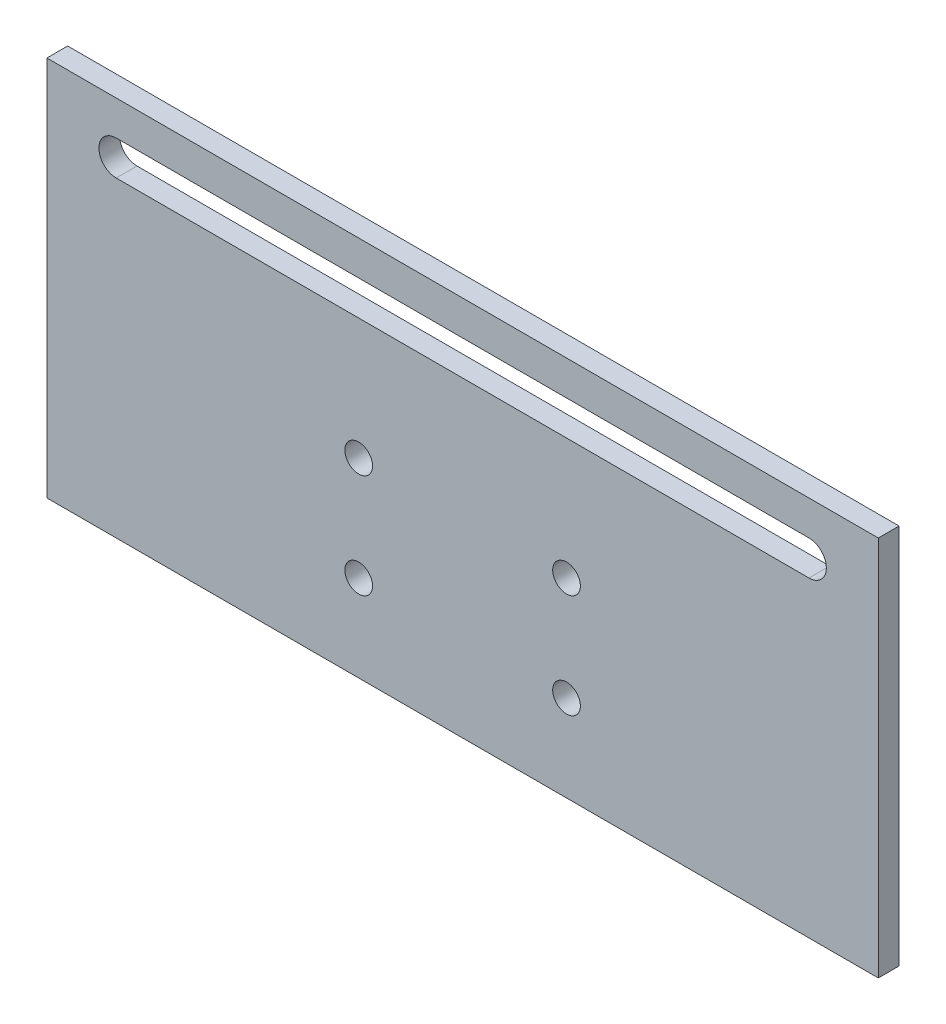
ISO-10303-21;
HEADER;
FILE_DESCRIPTION(('STEP AP214'),'2;1');
FILE_NAME('part.step','',(''),(''),'','','');
FILE_SCHEMA(('AUTOMOTIVE_DESIGN { 1 0 10303 214 1 1 1 1 }'));
ENDSEC;
DATA;
#1=APPLICATION_CONTEXT('core data for automotive mechanical design processes');
#2=APPLICATION_PROTOCOL_DEFINITION('international standard','automotive_design',2000,#1);
#3=PRODUCT_CONTEXT('',#1,'mechanical');
#4=PRODUCT('Part','Part','',(#3));
#5=PRODUCT_RELATED_PRODUCT_CATEGORY('part','',(#4));
#6=PRODUCT_DEFINITION_FORMATION('','',#4);
#7=PRODUCT_DEFINITION_CONTEXT('part definition',#1,'design');
#8=PRODUCT_DEFINITION('design','',#6,#7);
#9=PRODUCT_DEFINITION_SHAPE('','',#8);
#10=(LENGTH_UNIT() NAMED_UNIT(*) SI_UNIT(.MILLI.,.METRE.));
#11=(NAMED_UNIT(*) PLANE_ANGLE_UNIT() SI_UNIT($,.RADIAN.));
#12=(NAMED_UNIT(*) SI_UNIT($,.STERADIAN.) SOLID_ANGLE_UNIT());
#13=UNCERTAINTY_MEASURE_WITH_UNIT(LENGTH_MEASURE(1.E-05),#10,'distance_accuracy_value','');
#14=(GEOMETRIC_REPRESENTATION_CONTEXT(3) GLOBAL_UNCERTAINTY_ASSIGNED_CONTEXT((#13)) GLOBAL_UNIT_ASSIGNED_CONTEXT((#10,
#11,#12)) REPRESENTATION_CONTEXT('',''));
#15=CARTESIAN_POINT('',(0.,0.,0.));
#16=DIRECTION('',(0.,0.,1.));
#17=DIRECTION('',(1.,0.,0.));
#18=AXIS2_PLACEMENT_3D('',#15,#16,#17);
#19=CARTESIAN_POINT('',(0.,0.,1.5));
#20=DIRECTION('',(0.,0.,1.));
#21=DIRECTION('',(1.,0.,0.));
#22=AXIS2_PLACEMENT_3D('',#19,#20,#21);
#23=PLANE('',#22);
#24=CARTESIAN_POINT('',(15.,-15.,1.5));
#25=DIRECTION('',(0.,0.,1.));
#26=DIRECTION('',(1.,0.,0.));
#27=AXIS2_PLACEMENT_3D('',#24,#25,#26);
#28=CIRCLE('',#27,2.);
#29=CARTESIAN_POINT('',(17.,-15.,1.5));
#30=VERTEX_POINT('',#29);
#31=EDGE_CURVE('E245',#30,#30,#28,.T.);
#32=ORIENTED_EDGE('',*,*,#31,.F.);
#33=EDGE_LOOP('',(#32));
#34=FACE_BOUND('',#33,.T.);
#35=CARTESIAN_POINT('',(-15.,0.,1.5));
#36=DIRECTION('',(0.,0.,1.));
#37=DIRECTION('',(1.,0.,0.));
#38=AXIS2_PLACEMENT_3D('',#35,#36,#37);
#39=CIRCLE('',#38,2.);
#40=CARTESIAN_POINT('',(-13.,0.,1.5));
#41=VERTEX_POINT('',#40);
#42=EDGE_CURVE('E127',#41,#41,#39,.T.);
#43=ORIENTED_EDGE('',*,*,#42,.F.);
#44=EDGE_LOOP('',(#43));
#45=FACE_BOUND('',#44,.T.);
#46=DIRECTION('',(0.,1.,0.));
#47=VECTOR('',#46,1.);
#48=CARTESIAN_POINT('',(60.,27.5,1.5));
#49=LINE('',#48,#47);
#50=CARTESIAN_POINT('',(60.,-27.5,1.5));
#51=VERTEX_POINT('',#50);
#52=CARTESIAN_POINT('',(60.,27.5,1.5));
#53=VERTEX_POINT('',#52);
#54=EDGE_CURVE('E137',#51,#53,#49,.T.);
#55=ORIENTED_EDGE('',*,*,#54,.T.);
#56=DIRECTION('',(-1.,0.,0.));
#57=VECTOR('',#56,1.);
#58=CARTESIAN_POINT('',(-60.,27.5,1.5));
#59=LINE('',#58,#57);
#60=CARTESIAN_POINT('',(-60.,27.5,1.5));
#61=VERTEX_POINT('',#60);
#62=EDGE_CURVE('E140',#53,#61,#59,.T.);
#63=ORIENTED_EDGE('',*,*,#62,.T.);
#64=DIRECTION('',(0.,-1.,0.));
#65=VECTOR('',#64,1.);
#66=CARTESIAN_POINT('',(-60.,27.5,1.5));
#67=LINE('',#66,#65);
#68=CARTESIAN_POINT('',(-60.,-27.5,1.5));
#69=VERTEX_POINT('',#68);
#70=EDGE_CURVE('E143',#61,#69,#67,.T.);
#71=ORIENTED_EDGE('',*,*,#70,.T.);
#72=DIRECTION('',(1.,0.,0.));
#73=VECTOR('',#72,1.);
#74=CARTESIAN_POINT('',(-60.,-27.5,1.5));
#75=LINE('',#74,#73);
#76=EDGE_CURVE('E145',#69,#51,#75,.T.);
#77=ORIENTED_EDGE('',*,*,#76,.T.);
#78=EDGE_LOOP('',(#55,#63,#71,#77));
#79=FACE_BOUND('',#78,.T.);
#80=DIRECTION('',(1.,0.,0.));
#81=VECTOR('',#80,1.);
#82=CARTESIAN_POINT('',(-50.,17.5,1.5));
#83=LINE('',#82,#81);
#84=CARTESIAN_POINT('',(-50.,17.5,1.5));
#85=VERTEX_POINT('',#84);
#86=CARTESIAN_POINT('',(50.,17.5,1.5));
#87=VERTEX_POINT('',#86);
#88=EDGE_CURVE('E106',#85,#87,#83,.T.);
#89=ORIENTED_EDGE('',*,*,#88,.F.);
#90=CARTESIAN_POINT('',(-50.,20.,1.5));
#91=DIRECTION('',(0.,0.,1.));
#92=DIRECTION('',(1.,0.,0.));
#93=AXIS2_PLACEMENT_3D('',#90,#91,#92);
#94=CIRCLE('',#93,2.5);
#95=CARTESIAN_POINT('',(-50.,22.5,1.5));
#96=VERTEX_POINT('',#95);
#97=EDGE_CURVE('E98',#96,#85,#94,.T.);
#98=ORIENTED_EDGE('',*,*,#97,.F.);
#99=DIRECTION('',(-1.,0.,0.));
#100=VECTOR('',#99,1.);
#101=CARTESIAN_POINT('',(-50.,22.5,1.5));
#102=LINE('',#101,#100);
#103=CARTESIAN_POINT('',(50.,22.5,1.5));
#104=VERTEX_POINT('',#103);
#105=EDGE_CURVE('E121',#104,#96,#102,.T.);
#106=ORIENTED_EDGE('',*,*,#105,.F.);
#107=CARTESIAN_POINT('',(50.,20.,1.5));
#108=DIRECTION('',(0.,0.,1.));
#109=DIRECTION('',(1.,0.,0.));
#110=AXIS2_PLACEMENT_3D('',#107,#108,#109);
#111=CIRCLE('',#110,2.5);
#112=EDGE_CURVE('E119',#87,#104,#111,.T.);
#113=ORIENTED_EDGE('',*,*,#112,.F.);
#114=EDGE_LOOP('',(#89,#98,#106,#113));
#115=FACE_BOUND('',#114,.T.);
#116=CARTESIAN_POINT('',(15.,0.,1.5));
#117=DIRECTION('',(0.,0.,1.));
#118=DIRECTION('',(1.,0.,0.));
#119=AXIS2_PLACEMENT_3D('',#116,#117,#118);
#120=CIRCLE('',#119,2.);
#121=CARTESIAN_POINT('',(17.,0.,1.5));
#122=VERTEX_POINT('',#121);
#123=EDGE_CURVE('E251',#122,#122,#120,.T.);
#124=ORIENTED_EDGE('',*,*,#123,.F.);
#125=EDGE_LOOP('',(#124));
#126=FACE_BOUND('',#125,.T.);
#127=CARTESIAN_POINT('',(-15.,-15.,1.5));
#128=DIRECTION('',(0.,0.,1.));
#129=DIRECTION('',(1.,0.,0.));
#130=AXIS2_PLACEMENT_3D('',#127,#128,#129);
#131=CIRCLE('',#130,2.);
#132=CARTESIAN_POINT('',(-13.,-15.,1.5));
#133=VERTEX_POINT('',#132);
#134=EDGE_CURVE('E236',#133,#133,#131,.T.);
#135=ORIENTED_EDGE('',*,*,#134,.F.);
#136=EDGE_LOOP('',(#135));
#137=FACE_BOUND('',#136,.T.);
#138=ADVANCED_FACE('F33',(#34,#45,#79,#115,#126,#137),#23,.T.);
#139=CARTESIAN_POINT('',(0.,0.,-1.5));
#140=DIRECTION('',(0.,0.,1.));
#141=DIRECTION('',(1.,0.,0.));
#142=AXIS2_PLACEMENT_3D('',#139,#140,#141);
#143=PLANE('',#142);
#144=DIRECTION('',(0.,1.,0.));
#145=VECTOR('',#144,1.);
#146=CARTESIAN_POINT('',(60.,27.5,-1.5));
#147=LINE('',#146,#145);
#148=CARTESIAN_POINT('',(60.,-27.5,-1.5));
#149=VERTEX_POINT('',#148);
#150=CARTESIAN_POINT('',(60.,27.5,-1.5));
#151=VERTEX_POINT('',#150);
#152=EDGE_CURVE('E114',#149,#151,#147,.T.);
#153=ORIENTED_EDGE('',*,*,#152,.F.);
#154=DIRECTION('',(1.,0.,0.));
#155=VECTOR('',#154,1.);
#156=CARTESIAN_POINT('',(-60.,-27.5,-1.5));
#157=LINE('',#156,#155);
#158=CARTESIAN_POINT('',(-60.,-27.5,-1.5));
#159=VERTEX_POINT('',#158);
#160=EDGE_CURVE('E141',#159,#149,#157,.T.);
#161=ORIENTED_EDGE('',*,*,#160,.F.);
#162=DIRECTION('',(0.,-1.,0.));
#163=VECTOR('',#162,1.);
#164=CARTESIAN_POINT('',(-60.,27.5,-1.5));
#165=LINE('',#164,#163);
#166=CARTESIAN_POINT('',(-60.,27.5,-1.5));
#167=VERTEX_POINT('',#166);
#168=EDGE_CURVE('E152',#167,#159,#165,.T.);
#169=ORIENTED_EDGE('',*,*,#168,.F.);
#170=DIRECTION('',(-1.,0.,0.));
#171=VECTOR('',#170,1.);
#172=CARTESIAN_POINT('',(-60.,27.5,-1.5));
#173=LINE('',#172,#171);
#174=EDGE_CURVE('E150',#151,#167,#173,.T.);
#175=ORIENTED_EDGE('',*,*,#174,.F.);
#176=EDGE_LOOP('',(#153,#161,#169,#175));
#177=FACE_BOUND('',#176,.T.);
#178=CARTESIAN_POINT('',(-50.,20.,-1.5));
#179=DIRECTION('',(0.,0.,1.));
#180=DIRECTION('',(1.,0.,0.));
#181=AXIS2_PLACEMENT_3D('',#178,#179,#180);
#182=CIRCLE('',#181,2.5);
#183=CARTESIAN_POINT('',(-50.,22.5,-1.5));
#184=VERTEX_POINT('',#183);
#185=CARTESIAN_POINT('',(-50.,17.5,-1.5));
#186=VERTEX_POINT('',#185);
#187=EDGE_CURVE('E56',#184,#186,#182,.T.);
#188=ORIENTED_EDGE('',*,*,#187,.T.);
#189=DIRECTION('',(1.,0.,0.));
#190=VECTOR('',#189,1.);
#191=CARTESIAN_POINT('',(-50.,17.5,-1.5));
#192=LINE('',#191,#190);
#193=CARTESIAN_POINT('',(50.,17.5,-1.5));
#194=VERTEX_POINT('',#193);
#195=EDGE_CURVE('E113',#186,#194,#192,.T.);
#196=ORIENTED_EDGE('',*,*,#195,.T.);
#197=CARTESIAN_POINT('',(50.,20.,-1.5));
#198=DIRECTION('',(0.,0.,1.));
#199=DIRECTION('',(1.,0.,0.));
#200=AXIS2_PLACEMENT_3D('',#197,#198,#199);
#201=CIRCLE('',#200,2.5);
#202=CARTESIAN_POINT('',(50.,22.5,-1.5));
#203=VERTEX_POINT('',#202);
#204=EDGE_CURVE('E129',#194,#203,#201,.T.);
#205=ORIENTED_EDGE('',*,*,#204,.T.);
#206=DIRECTION('',(-1.,0.,0.));
#207=VECTOR('',#206,1.);
#208=CARTESIAN_POINT('',(-50.,22.5,-1.5));
#209=LINE('',#208,#207);
#210=EDGE_CURVE('E107',#203,#184,#209,.T.);
#211=ORIENTED_EDGE('',*,*,#210,.T.);
#212=EDGE_LOOP('',(#188,#196,#205,#211));
#213=FACE_BOUND('',#212,.T.);
#214=CARTESIAN_POINT('',(-15.,0.,-1.5));
#215=DIRECTION('',(0.,0.,1.));
#216=DIRECTION('',(1.,0.,0.));
#217=AXIS2_PLACEMENT_3D('',#214,#215,#216);
#218=CIRCLE('',#217,2.);
#219=CARTESIAN_POINT('',(-13.,0.,-1.5));
#220=VERTEX_POINT('',#219);
#221=EDGE_CURVE('E254',#220,#220,#218,.T.);
#222=ORIENTED_EDGE('',*,*,#221,.T.);
#223=EDGE_LOOP('',(#222));
#224=FACE_BOUND('',#223,.T.);
#225=CARTESIAN_POINT('',(15.,0.,-1.5));
#226=DIRECTION('',(0.,0.,1.));
#227=DIRECTION('',(1.,0.,0.));
#228=AXIS2_PLACEMENT_3D('',#225,#226,#227);
#229=CIRCLE('',#228,2.);
#230=CARTESIAN_POINT('',(17.,0.,-1.5));
#231=VERTEX_POINT('',#230);
#232=EDGE_CURVE('E248',#231,#231,#229,.T.);
#233=ORIENTED_EDGE('',*,*,#232,.T.);
#234=EDGE_LOOP('',(#233));
#235=FACE_BOUND('',#234,.T.);
#236=CARTESIAN_POINT('',(15.,-15.,-1.5));
#237=DIRECTION('',(0.,0.,1.));
#238=DIRECTION('',(1.,0.,0.));
#239=AXIS2_PLACEMENT_3D('',#236,#237,#238);
#240=CIRCLE('',#239,2.);
#241=CARTESIAN_POINT('',(17.,-15.,-1.5));
#242=VERTEX_POINT('',#241);
#243=EDGE_CURVE('E242',#242,#242,#240,.T.);
#244=ORIENTED_EDGE('',*,*,#243,.T.);
#245=EDGE_LOOP('',(#244));
#246=FACE_BOUND('',#245,.T.);
#247=CARTESIAN_POINT('',(-15.,-15.,-1.5));
#248=DIRECTION('',(0.,0.,1.));
#249=DIRECTION('',(1.,0.,0.));
#250=AXIS2_PLACEMENT_3D('',#247,#248,#249);
#251=CIRCLE('',#250,2.);
#252=CARTESIAN_POINT('',(-13.,-15.,-1.5));
#253=VERTEX_POINT('',#252);
#254=EDGE_CURVE('E239',#253,#253,#251,.T.);
#255=ORIENTED_EDGE('',*,*,#254,.T.);
#256=EDGE_LOOP('',(#255));
#257=FACE_BOUND('',#256,.T.);
#258=ADVANCED_FACE('F170',(#177,#213,#224,#235,#246,#257),#143,.F.);
#259=CARTESIAN_POINT('',(60.,27.5,1.5));
#260=DIRECTION('',(-1.,0.,0.));
#261=DIRECTION('',(0.,-1.,0.));
#262=AXIS2_PLACEMENT_3D('',#259,#260,#261);
#263=PLANE('',#262);
#264=ORIENTED_EDGE('',*,*,#152,.T.);
#265=DIRECTION('',(0.,0.,-1.));
#266=VECTOR('',#265,1.);
#267=CARTESIAN_POINT('',(60.,27.5,1.5));
#268=LINE('',#267,#266);
#269=EDGE_CURVE('E11',#53,#151,#268,.T.);
#270=ORIENTED_EDGE('',*,*,#269,.F.);
#271=ORIENTED_EDGE('',*,*,#54,.F.);
#272=DIRECTION('',(0.,0.,-1.));
#273=VECTOR('',#272,1.);
#274=CARTESIAN_POINT('',(60.,-27.5,1.5));
#275=LINE('',#274,#273);
#276=EDGE_CURVE('E147',#51,#149,#275,.T.);
#277=ORIENTED_EDGE('',*,*,#276,.T.);
#278=EDGE_LOOP('',(#264,#270,#271,#277));
#279=FACE_BOUND('',#278,.T.);
#280=ADVANCED_FACE('F35',(#279),#263,.F.);
#281=CARTESIAN_POINT('',(-60.,27.5,1.5));
#282=DIRECTION('',(0.,-1.,0.));
#283=DIRECTION('',(0.,0.,-1.));
#284=AXIS2_PLACEMENT_3D('',#281,#282,#283);
#285=PLANE('',#284);
#286=ORIENTED_EDGE('',*,*,#174,.T.);
#287=DIRECTION('',(0.,0.,-1.));
#288=VECTOR('',#287,1.);
#289=CARTESIAN_POINT('',(-60.,27.5,1.5));
#290=LINE('',#289,#288);
#291=EDGE_CURVE('E41',#61,#167,#290,.T.);
#292=ORIENTED_EDGE('',*,*,#291,.F.);
#293=ORIENTED_EDGE('',*,*,#62,.F.);
#294=ORIENTED_EDGE('',*,*,#269,.T.);
#295=EDGE_LOOP('',(#286,#292,#293,#294));
#296=FACE_BOUND('',#295,.T.);
#297=ADVANCED_FACE('F180',(#296),#285,.F.);
#298=CARTESIAN_POINT('',(-60.,27.5,1.5));
#299=DIRECTION('',(1.,0.,0.));
#300=DIRECTION('',(0.,0.,-1.));
#301=AXIS2_PLACEMENT_3D('',#298,#299,#300);
#302=PLANE('',#301);
#303=ORIENTED_EDGE('',*,*,#168,.T.);
#304=DIRECTION('',(0.,0.,-1.));
#305=VECTOR('',#304,1.);
#306=CARTESIAN_POINT('',(-60.,-27.5,1.5));
#307=LINE('',#306,#305);
#308=EDGE_CURVE('E157',#69,#159,#307,.T.);
#309=ORIENTED_EDGE('',*,*,#308,.F.);
#310=ORIENTED_EDGE('',*,*,#70,.F.);
#311=ORIENTED_EDGE('',*,*,#291,.T.);
#312=EDGE_LOOP('',(#303,#309,#310,#311));
#313=FACE_BOUND('',#312,.T.);
#314=ADVANCED_FACE('F164',(#313),#302,.F.);
#315=CARTESIAN_POINT('',(-60.,-27.5,1.5));
#316=DIRECTION('',(0.,1.,0.));
#317=DIRECTION('',(0.,0.,1.));
#318=AXIS2_PLACEMENT_3D('',#315,#316,#317);
#319=PLANE('',#318);
#320=ORIENTED_EDGE('',*,*,#160,.T.);
#321=ORIENTED_EDGE('',*,*,#276,.F.);
#322=ORIENTED_EDGE('',*,*,#76,.F.);
#323=ORIENTED_EDGE('',*,*,#308,.T.);
#324=EDGE_LOOP('',(#320,#321,#322,#323));
#325=FACE_BOUND('',#324,.T.);
#326=ADVANCED_FACE('F174',(#325),#319,.F.);
#327=CARTESIAN_POINT('',(-50.,20.,1.5));
#328=DIRECTION('',(0.,0.,-1.));
#329=DIRECTION('',(-1.,0.,0.));
#330=AXIS2_PLACEMENT_3D('',#327,#328,#329);
#331=CYLINDRICAL_SURFACE('',#330,2.5);
#332=ORIENTED_EDGE('',*,*,#187,.F.);
#333=DIRECTION('',(0.,0.,-1.));
#334=VECTOR('',#333,1.);
#335=CARTESIAN_POINT('',(-50.,22.5,1.5));
#336=LINE('',#335,#334);
#337=EDGE_CURVE('E102',#96,#184,#336,.T.);
#338=ORIENTED_EDGE('',*,*,#337,.F.);
#339=ORIENTED_EDGE('',*,*,#97,.T.);
#340=DIRECTION('',(0.,0.,-1.));
#341=VECTOR('',#340,1.);
#342=CARTESIAN_POINT('',(-50.,17.5,1.5));
#343=LINE('',#342,#341);
#344=EDGE_CURVE('E101',#85,#186,#343,.T.);
#345=ORIENTED_EDGE('',*,*,#344,.T.);
#346=EDGE_LOOP('',(#332,#338,#339,#345));
#347=FACE_BOUND('',#346,.T.);
#348=ADVANCED_FACE('F100',(#347),#331,.F.);
#349=CARTESIAN_POINT('',(-50.,17.5,1.5));
#350=DIRECTION('',(0.,1.,0.));
#351=DIRECTION('',(0.,0.,1.));
#352=AXIS2_PLACEMENT_3D('',#349,#350,#351);
#353=PLANE('',#352);
#354=ORIENTED_EDGE('',*,*,#195,.F.);
#355=ORIENTED_EDGE('',*,*,#344,.F.);
#356=ORIENTED_EDGE('',*,*,#88,.T.);
#357=DIRECTION('',(0.,0.,-1.));
#358=VECTOR('',#357,1.);
#359=CARTESIAN_POINT('',(50.,17.5,1.5));
#360=LINE('',#359,#358);
#361=EDGE_CURVE('E115',#87,#194,#360,.T.);
#362=ORIENTED_EDGE('',*,*,#361,.T.);
#363=EDGE_LOOP('',(#354,#355,#356,#362));
#364=FACE_BOUND('',#363,.T.);
#365=ADVANCED_FACE('F110',(#364),#353,.T.);
#366=CARTESIAN_POINT('',(50.,20.,1.5));
#367=DIRECTION('',(0.,0.,-1.));
#368=DIRECTION('',(-1.,0.,0.));
#369=AXIS2_PLACEMENT_3D('',#366,#367,#368);
#370=CYLINDRICAL_SURFACE('',#369,2.5);
#371=ORIENTED_EDGE('',*,*,#204,.F.);
#372=ORIENTED_EDGE('',*,*,#361,.F.);
#373=ORIENTED_EDGE('',*,*,#112,.T.);
#374=DIRECTION('',(0.,0.,-1.));
#375=VECTOR('',#374,1.);
#376=CARTESIAN_POINT('',(50.,22.5,1.5));
#377=LINE('',#376,#375);
#378=EDGE_CURVE('E48',#104,#203,#377,.T.);
#379=ORIENTED_EDGE('',*,*,#378,.T.);
#380=EDGE_LOOP('',(#371,#372,#373,#379));
#381=FACE_BOUND('',#380,.T.);
#382=ADVANCED_FACE('F206',(#381),#370,.F.);
#383=CARTESIAN_POINT('',(-50.,22.5,1.5));
#384=DIRECTION('',(0.,-1.,0.));
#385=DIRECTION('',(0.,0.,-1.));
#386=AXIS2_PLACEMENT_3D('',#383,#384,#385);
#387=PLANE('',#386);
#388=ORIENTED_EDGE('',*,*,#210,.F.);
#389=ORIENTED_EDGE('',*,*,#378,.F.);
#390=ORIENTED_EDGE('',*,*,#105,.T.);
#391=ORIENTED_EDGE('',*,*,#337,.T.);
#392=EDGE_LOOP('',(#388,#389,#390,#391));
#393=FACE_BOUND('',#392,.T.);
#394=ADVANCED_FACE('F210',(#393),#387,.T.);
#395=CARTESIAN_POINT('',(-15.,0.,1.5));
#396=DIRECTION('',(0.,0.,-1.));
#397=DIRECTION('',(-1.,0.,0.));
#398=AXIS2_PLACEMENT_3D('',#395,#396,#397);
#399=CYLINDRICAL_SURFACE('',#398,2.);
#400=ORIENTED_EDGE('',*,*,#42,.T.);
#401=EDGE_LOOP('',(#400));
#402=FACE_BOUND('',#401,.T.);
#403=ORIENTED_EDGE('',*,*,#221,.F.);
#404=EDGE_LOOP('',(#403));
#405=FACE_BOUND('',#404,.T.);
#406=ADVANCED_FACE('F216',(#402,#405),#399,.F.);
#407=CARTESIAN_POINT('',(15.,0.,1.5));
#408=DIRECTION('',(0.,0.,-1.));
#409=DIRECTION('',(-1.,0.,0.));
#410=AXIS2_PLACEMENT_3D('',#407,#408,#409);
#411=CYLINDRICAL_SURFACE('',#410,2.);
#412=ORIENTED_EDGE('',*,*,#123,.T.);
#413=EDGE_LOOP('',(#412));
#414=FACE_BOUND('',#413,.T.);
#415=ORIENTED_EDGE('',*,*,#232,.F.);
#416=EDGE_LOOP('',(#415));
#417=FACE_BOUND('',#416,.T.);
#418=ADVANCED_FACE('F219',(#414,#417),#411,.F.);
#419=CARTESIAN_POINT('',(15.,-15.,1.5));
#420=DIRECTION('',(0.,0.,-1.));
#421=DIRECTION('',(-1.,0.,0.));
#422=AXIS2_PLACEMENT_3D('',#419,#420,#421);
#423=CYLINDRICAL_SURFACE('',#422,2.);
#424=ORIENTED_EDGE('',*,*,#31,.T.);
#425=EDGE_LOOP('',(#424));
#426=FACE_BOUND('',#425,.T.);
#427=ORIENTED_EDGE('',*,*,#243,.F.);
#428=EDGE_LOOP('',(#427));
#429=FACE_BOUND('',#428,.T.);
#430=ADVANCED_FACE('F223',(#426,#429),#423,.F.);
#431=CARTESIAN_POINT('',(-15.,-15.,1.5));
#432=DIRECTION('',(0.,0.,-1.));
#433=DIRECTION('',(-1.,0.,0.));
#434=AXIS2_PLACEMENT_3D('',#431,#432,#433);
#435=CYLINDRICAL_SURFACE('',#434,2.);
#436=ORIENTED_EDGE('',*,*,#134,.T.);
#437=EDGE_LOOP('',(#436));
#438=FACE_BOUND('',#437,.T.);
#439=ORIENTED_EDGE('',*,*,#254,.F.);
#440=EDGE_LOOP('',(#439));
#441=FACE_BOUND('',#440,.T.);
#442=ADVANCED_FACE('F227',(#438,#441),#435,.F.);
#443=CLOSED_SHELL('',(#138,#258,#280,#297,#314,#326,#348,#365,#382,#394,#406,#418,#430,#442));
#444=MANIFOLD_SOLID_BREP('B2',#443);
#445=ADVANCED_BREP_SHAPE_REPRESENTATION('',(#18,#444),#14);
#446=SHAPE_DEFINITION_REPRESENTATION(#9,#445);
ENDSEC;
END-ISO-10303-21;
